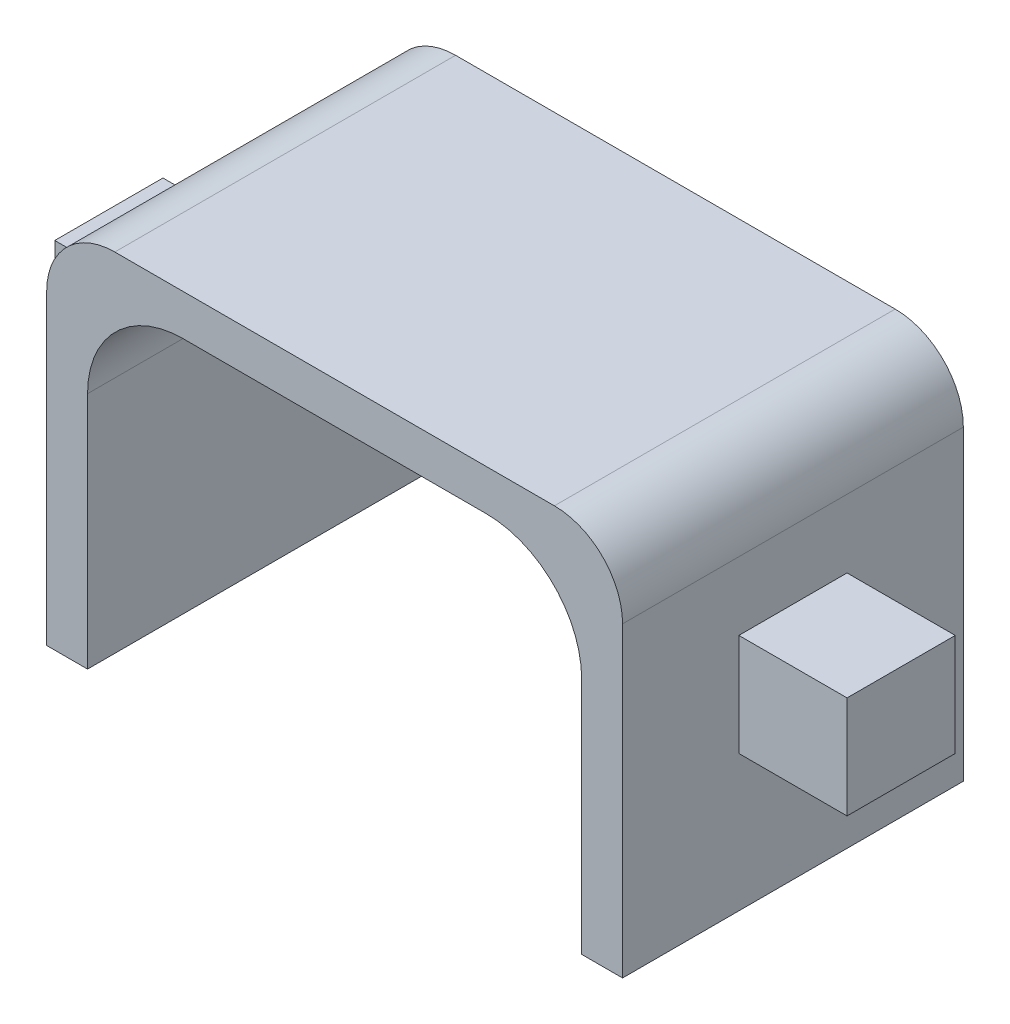
ISO-10303-21;
HEADER;
FILE_DESCRIPTION(('STEP AP214'),'2;1');
FILE_NAME('part.step','',(''),(''),'','','');
FILE_SCHEMA(('AUTOMOTIVE_DESIGN { 1 0 10303 214 1 1 1 1 }'));
ENDSEC;
DATA;
#1=APPLICATION_CONTEXT('core data for automotive mechanical design processes');
#2=APPLICATION_PROTOCOL_DEFINITION('international standard','automotive_design',2000,#1);
#3=PRODUCT_CONTEXT('',#1,'mechanical');
#4=PRODUCT('Part','Part','',(#3));
#5=PRODUCT_RELATED_PRODUCT_CATEGORY('part','',(#4));
#6=PRODUCT_DEFINITION_FORMATION('','',#4);
#7=PRODUCT_DEFINITION_CONTEXT('part definition',#1,'design');
#8=PRODUCT_DEFINITION('design','',#6,#7);
#9=PRODUCT_DEFINITION_SHAPE('','',#8);
#10=(LENGTH_UNIT() NAMED_UNIT(*) SI_UNIT(.MILLI.,.METRE.));
#11=(NAMED_UNIT(*) PLANE_ANGLE_UNIT() SI_UNIT($,.RADIAN.));
#12=(NAMED_UNIT(*) SI_UNIT($,.STERADIAN.) SOLID_ANGLE_UNIT());
#13=UNCERTAINTY_MEASURE_WITH_UNIT(LENGTH_MEASURE(1.E-05),#10,'distance_accuracy_value','');
#14=(GEOMETRIC_REPRESENTATION_CONTEXT(3) GLOBAL_UNCERTAINTY_ASSIGNED_CONTEXT((#13)) GLOBAL_UNIT_ASSIGNED_CONTEXT((#10,
#11,#12)) REPRESENTATION_CONTEXT('',''));
#15=CARTESIAN_POINT('',(0.,0.,0.));
#16=DIRECTION('',(0.,0.,1.));
#17=DIRECTION('',(1.,0.,0.));
#18=AXIS2_PLACEMENT_3D('',#15,#16,#17);
#19=CARTESIAN_POINT('',(0.,0.,1.5875));
#20=DIRECTION('',(0.,0.,-1.));
#21=DIRECTION('',(-1.,0.,0.));
#22=AXIS2_PLACEMENT_3D('',#19,#20,#21);
#23=PLANE('',#22);
#24=DIRECTION('',(0.,-1.,0.));
#25=VECTOR('',#24,1.);
#26=CARTESIAN_POINT('',(-8.45,0.,1.5875));
#27=LINE('',#26,#25);
#28=CARTESIAN_POINT('',(-8.45,7.,1.5875));
#29=VERTEX_POINT('',#28);
#30=CARTESIAN_POINT('',(-8.45,4.,1.5875));
#31=VERTEX_POINT('',#30);
#32=EDGE_CURVE('E209',#29,#31,#27,.T.);
#33=ORIENTED_EDGE('',*,*,#32,.F.);
#34=DIRECTION('',(-1.,0.,0.));
#35=VECTOR('',#34,1.);
#36=CARTESIAN_POINT('',(-8.45,7.,1.5875));
#37=LINE('',#36,#35);
#38=CARTESIAN_POINT('',(-11.625,7.,1.5875));
#39=VERTEX_POINT('',#38);
#40=EDGE_CURVE('E213',#29,#39,#37,.T.);
#41=ORIENTED_EDGE('',*,*,#40,.T.);
#42=DIRECTION('',(0.,-1.,0.));
#43=VECTOR('',#42,1.);
#44=CARTESIAN_POINT('',(-11.625,4.,1.5875));
#45=LINE('',#44,#43);
#46=CARTESIAN_POINT('',(-11.625,4.,1.5875));
#47=VERTEX_POINT('',#46);
#48=EDGE_CURVE('E215',#39,#47,#45,.T.);
#49=ORIENTED_EDGE('',*,*,#48,.T.);
#50=DIRECTION('',(1.,0.,0.));
#51=VECTOR('',#50,1.);
#52=CARTESIAN_POINT('',(-8.45,4.,1.5875));
#53=LINE('',#52,#51);
#54=EDGE_CURVE('E218',#47,#31,#53,.T.);
#55=ORIENTED_EDGE('',*,*,#54,.T.);
#56=EDGE_LOOP('',(#33,#41,#49,#55));
#57=FACE_BOUND('',#56,.T.);
#58=ADVANCED_FACE('F36',(#57),#23,.F.);
#59=DIRECTION('',(0.,1.,0.));
#60=VECTOR('',#59,1.);
#61=CARTESIAN_POINT('',(8.45,0.,1.5875));
#62=LINE('',#61,#60);
#63=CARTESIAN_POINT('',(8.45,4.,1.5875));
#64=VERTEX_POINT('',#63);
#65=CARTESIAN_POINT('',(8.45,7.,1.5875));
#66=VERTEX_POINT('',#65);
#67=EDGE_CURVE('E206',#64,#66,#62,.T.);
#68=ORIENTED_EDGE('',*,*,#67,.F.);
#69=DIRECTION('',(1.,0.,0.));
#70=VECTOR('',#69,1.);
#71=CARTESIAN_POINT('',(8.45,4.,1.5875));
#72=LINE('',#71,#70);
#73=CARTESIAN_POINT('',(11.625,4.,1.5875));
#74=VERTEX_POINT('',#73);
#75=EDGE_CURVE('E220',#64,#74,#72,.T.);
#76=ORIENTED_EDGE('',*,*,#75,.T.);
#77=DIRECTION('',(0.,1.,0.));
#78=VECTOR('',#77,1.);
#79=CARTESIAN_POINT('',(11.625,4.,1.5875));
#80=LINE('',#79,#78);
#81=CARTESIAN_POINT('',(11.625,7.,1.5875));
#82=VERTEX_POINT('',#81);
#83=EDGE_CURVE('E222',#74,#82,#80,.T.);
#84=ORIENTED_EDGE('',*,*,#83,.T.);
#85=DIRECTION('',(-1.,0.,0.));
#86=VECTOR('',#85,1.);
#87=CARTESIAN_POINT('',(8.45,7.,1.5875));
#88=LINE('',#87,#86);
#89=EDGE_CURVE('E224',#82,#66,#88,.T.);
#90=ORIENTED_EDGE('',*,*,#89,.T.);
#91=EDGE_LOOP('',(#68,#76,#84,#90));
#92=FACE_BOUND('',#91,.T.);
#93=ADVANCED_FACE('F371',(#92),#23,.F.);
#94=CARTESIAN_POINT('',(0.,0.,-1.5875));
#95=DIRECTION('',(0.,0.,-1.));
#96=DIRECTION('',(-1.,0.,0.));
#97=AXIS2_PLACEMENT_3D('',#94,#95,#96);
#98=PLANE('',#97);
#99=DIRECTION('',(-1.,0.,0.));
#100=VECTOR('',#99,1.);
#101=CARTESIAN_POINT('',(-8.45,7.,-1.5875));
#102=LINE('',#101,#100);
#103=CARTESIAN_POINT('',(-8.45,7.,-1.5875));
#104=VERTEX_POINT('',#103);
#105=CARTESIAN_POINT('',(-11.625,7.,-1.5875));
#106=VERTEX_POINT('',#105);
#107=EDGE_CURVE('E212',#104,#106,#102,.T.);
#108=ORIENTED_EDGE('',*,*,#107,.F.);
#109=DIRECTION('',(0.,-1.,0.));
#110=VECTOR('',#109,1.);
#111=CARTESIAN_POINT('',(-8.45,0.,-1.5875));
#112=LINE('',#111,#110);
#113=CARTESIAN_POINT('',(-8.45,4.,-1.5875));
#114=VERTEX_POINT('',#113);
#115=EDGE_CURVE('E269',#104,#114,#112,.T.);
#116=ORIENTED_EDGE('',*,*,#115,.T.);
#117=DIRECTION('',(1.,0.,0.));
#118=VECTOR('',#117,1.);
#119=CARTESIAN_POINT('',(-8.45,4.,-1.5875));
#120=LINE('',#119,#118);
#121=CARTESIAN_POINT('',(-11.625,4.,-1.5875));
#122=VERTEX_POINT('',#121);
#123=EDGE_CURVE('E230',#122,#114,#120,.T.);
#124=ORIENTED_EDGE('',*,*,#123,.F.);
#125=DIRECTION('',(0.,-1.,0.));
#126=VECTOR('',#125,1.);
#127=CARTESIAN_POINT('',(-11.625,4.,-1.5875));
#128=LINE('',#127,#126);
#129=EDGE_CURVE('E228',#106,#122,#128,.T.);
#130=ORIENTED_EDGE('',*,*,#129,.F.);
#131=EDGE_LOOP('',(#108,#116,#124,#130));
#132=FACE_BOUND('',#131,.T.);
#133=ADVANCED_FACE('F377',(#132),#98,.T.);
#134=DIRECTION('',(1.,0.,0.));
#135=VECTOR('',#134,1.);
#136=CARTESIAN_POINT('',(8.45,4.,-1.5875));
#137=LINE('',#136,#135);
#138=CARTESIAN_POINT('',(8.45,4.,-1.5875));
#139=VERTEX_POINT('',#138);
#140=CARTESIAN_POINT('',(11.625,4.,-1.5875));
#141=VERTEX_POINT('',#140);
#142=EDGE_CURVE('E233',#139,#141,#137,.T.);
#143=ORIENTED_EDGE('',*,*,#142,.F.);
#144=DIRECTION('',(0.,1.,0.));
#145=VECTOR('',#144,1.);
#146=CARTESIAN_POINT('',(8.45,0.,-1.5875));
#147=LINE('',#146,#145);
#148=CARTESIAN_POINT('',(8.45,7.,-1.5875));
#149=VERTEX_POINT('',#148);
#150=EDGE_CURVE('E267',#139,#149,#147,.T.);
#151=ORIENTED_EDGE('',*,*,#150,.T.);
#152=DIRECTION('',(-1.,0.,0.));
#153=VECTOR('',#152,1.);
#154=CARTESIAN_POINT('',(8.45,7.,-1.5875));
#155=LINE('',#154,#153);
#156=CARTESIAN_POINT('',(11.625,7.,-1.5875));
#157=VERTEX_POINT('',#156);
#158=EDGE_CURVE('E216',#157,#149,#155,.T.);
#159=ORIENTED_EDGE('',*,*,#158,.F.);
#160=DIRECTION('',(0.,1.,0.));
#161=VECTOR('',#160,1.);
#162=CARTESIAN_POINT('',(11.625,4.,-1.5875));
#163=LINE('',#162,#161);
#164=EDGE_CURVE('E235',#141,#157,#163,.T.);
#165=ORIENTED_EDGE('',*,*,#164,.F.);
#166=EDGE_LOOP('',(#143,#151,#159,#165));
#167=FACE_BOUND('',#166,.T.);
#168=ADVANCED_FACE('F384',(#167),#98,.T.);
#169=CARTESIAN_POINT('',(-8.45,11.,1.5875));
#170=DIRECTION('',(0.,-1.,0.));
#171=DIRECTION('',(0.,0.,-1.));
#172=AXIS2_PLACEMENT_3D('',#169,#170,#171);
#173=PLANE('',#172);
#174=DIRECTION('',(-1.,0.,0.));
#175=VECTOR('',#174,1.);
#176=CARTESIAN_POINT('',(8.45,11.,5.));
#177=LINE('',#176,#175);
#178=CARTESIAN_POINT('',(6.45,11.,5.));
#179=VERTEX_POINT('',#178);
#180=CARTESIAN_POINT('',(-6.45,11.,5.));
#181=VERTEX_POINT('',#180);
#182=EDGE_CURVE('E287',#179,#181,#177,.T.);
#183=ORIENTED_EDGE('',*,*,#182,.F.);
#184=DIRECTION('',(0.,0.,-1.));
#185=VECTOR('',#184,1.);
#186=CARTESIAN_POINT('',(6.45,11.,1.5875));
#187=LINE('',#186,#185);
#188=CARTESIAN_POINT('',(6.45,11.,-5.));
#189=VERTEX_POINT('',#188);
#190=EDGE_CURVE('E273',#179,#189,#187,.T.);
#191=ORIENTED_EDGE('',*,*,#190,.T.);
#192=DIRECTION('',(-1.,0.,0.));
#193=VECTOR('',#192,1.);
#194=CARTESIAN_POINT('',(8.45,11.,-5.));
#195=LINE('',#194,#193);
#196=CARTESIAN_POINT('',(-6.45,11.,-5.));
#197=VERTEX_POINT('',#196);
#198=EDGE_CURVE('E300',#189,#197,#195,.T.);
#199=ORIENTED_EDGE('',*,*,#198,.T.);
#200=DIRECTION('',(0.,0.,-1.));
#201=VECTOR('',#200,1.);
#202=CARTESIAN_POINT('',(-6.45,11.,1.5875));
#203=LINE('',#202,#201);
#204=EDGE_CURVE('E271',#197,#181,#203,.F.);
#205=ORIENTED_EDGE('',*,*,#204,.T.);
#206=EDGE_LOOP('',(#183,#191,#199,#205));
#207=FACE_BOUND('',#206,.T.);
#208=ADVANCED_FACE('F293',(#207),#173,.F.);
#209=CARTESIAN_POINT('',(-8.45,7.,1.5875));
#210=DIRECTION('',(0.,-1.,0.));
#211=DIRECTION('',(0.,0.,-1.));
#212=AXIS2_PLACEMENT_3D('',#209,#210,#211);
#213=PLANE('',#212);
#214=ORIENTED_EDGE('',*,*,#107,.T.);
#215=DIRECTION('',(0.,0.,-1.));
#216=VECTOR('',#215,1.);
#217=CARTESIAN_POINT('',(-11.625,7.,1.5875));
#218=LINE('',#217,#216);
#219=EDGE_CURVE('E261',#39,#106,#218,.T.);
#220=ORIENTED_EDGE('',*,*,#219,.F.);
#221=ORIENTED_EDGE('',*,*,#40,.F.);
#222=DIRECTION('',(0.,0.,-1.));
#223=VECTOR('',#222,1.);
#224=CARTESIAN_POINT('',(-8.45,7.,1.5875));
#225=LINE('',#224,#223);
#226=EDGE_CURVE('E264',#29,#104,#225,.T.);
#227=ORIENTED_EDGE('',*,*,#226,.T.);
#228=EDGE_LOOP('',(#214,#220,#221,#227));
#229=FACE_BOUND('',#228,.T.);
#230=ADVANCED_FACE('F415',(#229),#213,.F.);
#231=CARTESIAN_POINT('',(-11.625,4.,1.5875));
#232=DIRECTION('',(1.,0.,0.));
#233=DIRECTION('',(0.,1.,0.));
#234=AXIS2_PLACEMENT_3D('',#231,#232,#233);
#235=PLANE('',#234);
#236=ORIENTED_EDGE('',*,*,#129,.T.);
#237=DIRECTION('',(0.,0.,-1.));
#238=VECTOR('',#237,1.);
#239=CARTESIAN_POINT('',(-11.625,4.,1.5875));
#240=LINE('',#239,#238);
#241=EDGE_CURVE('E258',#47,#122,#240,.T.);
#242=ORIENTED_EDGE('',*,*,#241,.F.);
#243=ORIENTED_EDGE('',*,*,#48,.F.);
#244=ORIENTED_EDGE('',*,*,#219,.T.);
#245=EDGE_LOOP('',(#236,#242,#243,#244));
#246=FACE_BOUND('',#245,.T.);
#247=ADVANCED_FACE('F411',(#246),#235,.F.);
#248=CARTESIAN_POINT('',(-8.45,4.,1.5875));
#249=DIRECTION('',(0.,1.,0.));
#250=DIRECTION('',(0.,0.,1.));
#251=AXIS2_PLACEMENT_3D('',#248,#249,#250);
#252=PLANE('',#251);
#253=ORIENTED_EDGE('',*,*,#123,.T.);
#254=DIRECTION('',(0.,0.,-1.));
#255=VECTOR('',#254,1.);
#256=CARTESIAN_POINT('',(-8.45,4.,1.5875));
#257=LINE('',#256,#255);
#258=EDGE_CURVE('E255',#31,#114,#257,.T.);
#259=ORIENTED_EDGE('',*,*,#258,.F.);
#260=ORIENTED_EDGE('',*,*,#54,.F.);
#261=ORIENTED_EDGE('',*,*,#241,.T.);
#262=EDGE_LOOP('',(#253,#259,#260,#261));
#263=FACE_BOUND('',#262,.T.);
#264=ADVANCED_FACE('F407',(#263),#252,.F.);
#265=CARTESIAN_POINT('',(-8.45,4.,1.5875));
#266=DIRECTION('',(1.,0.,0.));
#267=DIRECTION('',(0.,0.,-1.));
#268=AXIS2_PLACEMENT_3D('',#265,#266,#267);
#269=PLANE('',#268);
#270=ORIENTED_EDGE('',*,*,#226,.F.);
#271=ORIENTED_EDGE('',*,*,#32,.T.);
#272=ORIENTED_EDGE('',*,*,#258,.T.);
#273=ORIENTED_EDGE('',*,*,#115,.F.);
#274=EDGE_LOOP('',(#270,#271,#272,#273));
#275=FACE_BOUND('',#274,.T.);
#276=DIRECTION('',(0.,-1.,0.));
#277=VECTOR('',#276,1.);
#278=CARTESIAN_POINT('',(-8.45,11.,5.));
#279=LINE('',#278,#277);
#280=CARTESIAN_POINT('',(-8.45,9.,5.));
#281=VERTEX_POINT('',#280);
#282=CARTESIAN_POINT('',(-8.45,0.,5.));
#283=VERTEX_POINT('',#282);
#284=EDGE_CURVE('E297',#281,#283,#279,.T.);
#285=ORIENTED_EDGE('',*,*,#284,.F.);
#286=DIRECTION('',(0.,0.,-1.));
#287=VECTOR('',#286,1.);
#288=CARTESIAN_POINT('',(-8.45,9.,1.5875));
#289=LINE('',#288,#287);
#290=CARTESIAN_POINT('',(-8.45,9.,-5.));
#291=VERTEX_POINT('',#290);
#292=EDGE_CURVE('E11',#281,#291,#289,.T.);
#293=ORIENTED_EDGE('',*,*,#292,.T.);
#294=DIRECTION('',(0.,-1.,0.));
#295=VECTOR('',#294,1.);
#296=CARTESIAN_POINT('',(-8.45,4.,-5.));
#297=LINE('',#296,#295);
#298=CARTESIAN_POINT('',(-8.45,0.,-5.));
#299=VERTEX_POINT('',#298);
#300=EDGE_CURVE('E202',#291,#299,#297,.T.);
#301=ORIENTED_EDGE('',*,*,#300,.T.);
#302=DIRECTION('',(0.,0.,-1.));
#303=VECTOR('',#302,1.);
#304=CARTESIAN_POINT('',(-8.45,0.,1.5875));
#305=LINE('',#304,#303);
#306=EDGE_CURVE('E252',#283,#299,#305,.T.);
#307=ORIENTED_EDGE('',*,*,#306,.F.);
#308=EDGE_LOOP('',(#285,#293,#301,#307));
#309=FACE_BOUND('',#308,.T.);
#310=ADVANCED_FACE('F315',(#275,#309),#269,.F.);
#311=CARTESIAN_POINT('',(-6.45,0.,1.5875));
#312=DIRECTION('',(0.,1.,0.));
#313=DIRECTION('',(0.,0.,1.));
#314=AXIS2_PLACEMENT_3D('',#311,#312,#313);
#315=PLANE('',#314);
#316=DIRECTION('',(1.,0.,0.));
#317=VECTOR('',#316,1.);
#318=CARTESIAN_POINT('',(-8.45,0.,-5.));
#319=LINE('',#318,#317);
#320=CARTESIAN_POINT('',(-7.25,0.,-5.));
#321=VERTEX_POINT('',#320);
#322=EDGE_CURVE('E197',#299,#321,#319,.T.);
#323=ORIENTED_EDGE('',*,*,#322,.T.);
#324=DIRECTION('',(0.,0.,1.));
#325=VECTOR('',#324,1.);
#326=CARTESIAN_POINT('',(-7.25,0.,-5.));
#327=LINE('',#326,#325);
#328=CARTESIAN_POINT('',(-7.25,0.,5.));
#329=VERTEX_POINT('',#328);
#330=EDGE_CURVE('E311',#321,#329,#327,.T.);
#331=ORIENTED_EDGE('',*,*,#330,.T.);
#332=DIRECTION('',(1.,0.,0.));
#333=VECTOR('',#332,1.);
#334=CARTESIAN_POINT('',(-8.45,0.,5.));
#335=LINE('',#334,#333);
#336=EDGE_CURVE('E307',#283,#329,#335,.T.);
#337=ORIENTED_EDGE('',*,*,#336,.F.);
#338=ORIENTED_EDGE('',*,*,#306,.T.);
#339=EDGE_LOOP('',(#323,#331,#337,#338));
#340=FACE_BOUND('',#339,.T.);
#341=ADVANCED_FACE('F320',(#340),#315,.F.);
#342=CARTESIAN_POINT('',(6.45,0.,1.5875));
#343=DIRECTION('',(0.,1.,0.));
#344=DIRECTION('',(0.,0.,1.));
#345=AXIS2_PLACEMENT_3D('',#342,#343,#344);
#346=PLANE('',#345);
#347=DIRECTION('',(1.,0.,0.));
#348=VECTOR('',#347,1.);
#349=CARTESIAN_POINT('',(6.45,0.,5.));
#350=LINE('',#349,#348);
#351=CARTESIAN_POINT('',(7.25,0.,5.));
#352=VERTEX_POINT('',#351);
#353=CARTESIAN_POINT('',(8.45,0.,5.));
#354=VERTEX_POINT('',#353);
#355=EDGE_CURVE('E189',#352,#354,#350,.T.);
#356=ORIENTED_EDGE('',*,*,#355,.F.);
#357=DIRECTION('',(0.,0.,1.));
#358=VECTOR('',#357,1.);
#359=CARTESIAN_POINT('',(7.25,0.,-5.));
#360=LINE('',#359,#358);
#361=CARTESIAN_POINT('',(7.25,0.,-5.));
#362=VERTEX_POINT('',#361);
#363=EDGE_CURVE('E51',#362,#352,#360,.T.);
#364=ORIENTED_EDGE('',*,*,#363,.F.);
#365=DIRECTION('',(1.,0.,0.));
#366=VECTOR('',#365,1.);
#367=CARTESIAN_POINT('',(6.45,0.,-5.));
#368=LINE('',#367,#366);
#369=CARTESIAN_POINT('',(8.45,0.,-5.));
#370=VERTEX_POINT('',#369);
#371=EDGE_CURVE('E187',#362,#370,#368,.T.);
#372=ORIENTED_EDGE('',*,*,#371,.T.);
#373=DIRECTION('',(0.,0.,-1.));
#374=VECTOR('',#373,1.);
#375=CARTESIAN_POINT('',(8.45,0.,1.5875));
#376=LINE('',#375,#374);
#377=EDGE_CURVE('E250',#354,#370,#376,.T.);
#378=ORIENTED_EDGE('',*,*,#377,.F.);
#379=EDGE_LOOP('',(#356,#364,#372,#378));
#380=FACE_BOUND('',#379,.T.);
#381=ADVANCED_FACE('F185',(#380),#346,.F.);
#382=CARTESIAN_POINT('',(8.45,4.,1.5875));
#383=DIRECTION('',(0.,1.,0.));
#384=DIRECTION('',(0.,0.,1.));
#385=AXIS2_PLACEMENT_3D('',#382,#383,#384);
#386=PLANE('',#385);
#387=ORIENTED_EDGE('',*,*,#142,.T.);
#388=DIRECTION('',(0.,0.,-1.));
#389=VECTOR('',#388,1.);
#390=CARTESIAN_POINT('',(11.625,4.,1.5875));
#391=LINE('',#390,#389);
#392=EDGE_CURVE('E244',#74,#141,#391,.T.);
#393=ORIENTED_EDGE('',*,*,#392,.F.);
#394=ORIENTED_EDGE('',*,*,#75,.F.);
#395=DIRECTION('',(0.,0.,-1.));
#396=VECTOR('',#395,1.);
#397=CARTESIAN_POINT('',(8.45,4.,1.5875));
#398=LINE('',#397,#396);
#399=EDGE_CURVE('E247',#64,#139,#398,.T.);
#400=ORIENTED_EDGE('',*,*,#399,.T.);
#401=EDGE_LOOP('',(#387,#393,#394,#400));
#402=FACE_BOUND('',#401,.T.);
#403=ADVANCED_FACE('F396',(#402),#386,.F.);
#404=CARTESIAN_POINT('',(11.625,4.,1.5875));
#405=DIRECTION('',(-1.,0.,0.));
#406=DIRECTION('',(0.,-1.,0.));
#407=AXIS2_PLACEMENT_3D('',#404,#405,#406);
#408=PLANE('',#407);
#409=ORIENTED_EDGE('',*,*,#164,.T.);
#410=DIRECTION('',(0.,0.,-1.));
#411=VECTOR('',#410,1.);
#412=CARTESIAN_POINT('',(11.625,7.,1.5875));
#413=LINE('',#412,#411);
#414=EDGE_CURVE('E241',#82,#157,#413,.T.);
#415=ORIENTED_EDGE('',*,*,#414,.F.);
#416=ORIENTED_EDGE('',*,*,#83,.F.);
#417=ORIENTED_EDGE('',*,*,#392,.T.);
#418=EDGE_LOOP('',(#409,#415,#416,#417));
#419=FACE_BOUND('',#418,.T.);
#420=ADVANCED_FACE('F392',(#419),#408,.F.);
#421=CARTESIAN_POINT('',(8.45,7.,1.5875));
#422=DIRECTION('',(0.,-1.,0.));
#423=DIRECTION('',(0.,0.,-1.));
#424=AXIS2_PLACEMENT_3D('',#421,#422,#423);
#425=PLANE('',#424);
#426=ORIENTED_EDGE('',*,*,#158,.T.);
#427=DIRECTION('',(0.,0.,-1.));
#428=VECTOR('',#427,1.);
#429=CARTESIAN_POINT('',(8.45,7.,1.5875));
#430=LINE('',#429,#428);
#431=EDGE_CURVE('E226',#66,#149,#430,.T.);
#432=ORIENTED_EDGE('',*,*,#431,.F.);
#433=ORIENTED_EDGE('',*,*,#89,.F.);
#434=ORIENTED_EDGE('',*,*,#414,.T.);
#435=EDGE_LOOP('',(#426,#432,#433,#434));
#436=FACE_BOUND('',#435,.T.);
#437=ADVANCED_FACE('F388',(#436),#425,.F.);
#438=CARTESIAN_POINT('',(8.45,11.,1.5875));
#439=DIRECTION('',(-1.,0.,0.));
#440=DIRECTION('',(0.,0.,1.));
#441=AXIS2_PLACEMENT_3D('',#438,#439,#440);
#442=PLANE('',#441);
#443=ORIENTED_EDGE('',*,*,#399,.F.);
#444=ORIENTED_EDGE('',*,*,#67,.T.);
#445=ORIENTED_EDGE('',*,*,#431,.T.);
#446=ORIENTED_EDGE('',*,*,#150,.F.);
#447=EDGE_LOOP('',(#443,#444,#445,#446));
#448=FACE_BOUND('',#447,.T.);
#449=DIRECTION('',(0.,1.,0.));
#450=VECTOR('',#449,1.);
#451=CARTESIAN_POINT('',(8.45,7.,-5.));
#452=LINE('',#451,#450);
#453=CARTESIAN_POINT('',(8.45,9.,-5.));
#454=VERTEX_POINT('',#453);
#455=EDGE_CURVE('E196',#370,#454,#452,.T.);
#456=ORIENTED_EDGE('',*,*,#455,.T.);
#457=DIRECTION('',(0.,0.,-1.));
#458=VECTOR('',#457,1.);
#459=CARTESIAN_POINT('',(8.45,9.,1.5875));
#460=LINE('',#459,#458);
#461=CARTESIAN_POINT('',(8.45,9.,5.));
#462=VERTEX_POINT('',#461);
#463=EDGE_CURVE('E280',#454,#462,#460,.F.);
#464=ORIENTED_EDGE('',*,*,#463,.T.);
#465=DIRECTION('',(0.,1.,0.));
#466=VECTOR('',#465,1.);
#467=CARTESIAN_POINT('',(8.45,7.,5.));
#468=LINE('',#467,#466);
#469=EDGE_CURVE('E199',#354,#462,#468,.T.);
#470=ORIENTED_EDGE('',*,*,#469,.F.);
#471=ORIENTED_EDGE('',*,*,#377,.T.);
#472=EDGE_LOOP('',(#456,#464,#470,#471));
#473=FACE_BOUND('',#472,.T.);
#474=ADVANCED_FACE('F302',(#448,#473),#442,.F.);
#475=CARTESIAN_POINT('',(0.,0.,-5.));
#476=DIRECTION('',(0.,0.,1.));
#477=DIRECTION('',(1.,0.,0.));
#478=AXIS2_PLACEMENT_3D('',#475,#476,#477);
#479=PLANE('',#478);
#480=CARTESIAN_POINT('',(-4.45,7.,-5.));
#481=DIRECTION('',(0.,0.,1.));
#482=DIRECTION('',(1.,0.,0.));
#483=AXIS2_PLACEMENT_3D('',#480,#481,#482);
#484=CIRCLE('',#483,2.8);
#485=CARTESIAN_POINT('',(-4.45,9.8,-5.));
#486=VERTEX_POINT('',#485);
#487=CARTESIAN_POINT('',(-7.25,7.,-5.));
#488=VERTEX_POINT('',#487);
#489=EDGE_CURVE('E326',#486,#488,#484,.T.);
#490=ORIENTED_EDGE('',*,*,#489,.T.);
#491=DIRECTION('',(0.,-1.,0.));
#492=VECTOR('',#491,1.);
#493=CARTESIAN_POINT('',(-7.25,0.,-5.));
#494=LINE('',#493,#492);
#495=EDGE_CURVE('E190',#488,#321,#494,.T.);
#496=ORIENTED_EDGE('',*,*,#495,.T.);
#497=ORIENTED_EDGE('',*,*,#322,.F.);
#498=ORIENTED_EDGE('',*,*,#300,.F.);
#499=CARTESIAN_POINT('',(-6.45,9.,-5.));
#500=DIRECTION('',(0.,0.,1.));
#501=DIRECTION('',(1.,0.,0.));
#502=AXIS2_PLACEMENT_3D('',#499,#500,#501);
#503=CIRCLE('',#502,2.);
#504=EDGE_CURVE('E276',#291,#197,#503,.F.);
#505=ORIENTED_EDGE('',*,*,#504,.T.);
#506=ORIENTED_EDGE('',*,*,#198,.F.);
#507=CARTESIAN_POINT('',(6.45,9.,-5.));
#508=DIRECTION('',(0.,0.,1.));
#509=DIRECTION('',(1.,0.,0.));
#510=AXIS2_PLACEMENT_3D('',#507,#508,#509);
#511=CIRCLE('',#510,2.);
#512=EDGE_CURVE('E278',#189,#454,#511,.F.);
#513=ORIENTED_EDGE('',*,*,#512,.T.);
#514=ORIENTED_EDGE('',*,*,#455,.F.);
#515=ORIENTED_EDGE('',*,*,#371,.F.);
#516=DIRECTION('',(0.,1.,0.));
#517=VECTOR('',#516,1.);
#518=CARTESIAN_POINT('',(7.25,7.,-5.));
#519=LINE('',#518,#517);
#520=CARTESIAN_POINT('',(7.25,7.,-5.));
#521=VERTEX_POINT('',#520);
#522=EDGE_CURVE('E173',#362,#521,#519,.T.);
#523=ORIENTED_EDGE('',*,*,#522,.T.);
#524=CARTESIAN_POINT('',(4.45,7.,-5.));
#525=DIRECTION('',(0.,0.,1.));
#526=DIRECTION('',(1.,0.,0.));
#527=AXIS2_PLACEMENT_3D('',#524,#525,#526);
#528=CIRCLE('',#527,2.8);
#529=CARTESIAN_POINT('',(4.44999999999999,9.8,-5.));
#530=VERTEX_POINT('',#529);
#531=EDGE_CURVE('E180',#521,#530,#528,.T.);
#532=ORIENTED_EDGE('',*,*,#531,.T.);
#533=DIRECTION('',(-1.,0.,0.));
#534=VECTOR('',#533,1.);
#535=CARTESIAN_POINT('',(-4.45,9.8,-5.));
#536=LINE('',#535,#534);
#537=EDGE_CURVE('E329',#530,#486,#536,.T.);
#538=ORIENTED_EDGE('',*,*,#537,.T.);
#539=EDGE_LOOP('',(#490,#496,#497,#498,#505,#506,#513,#514,#515,#523,#532,#538));
#540=FACE_BOUND('',#539,.T.);
#541=ADVANCED_FACE('F194',(#540),#479,.F.);
#542=CARTESIAN_POINT('',(0.,0.,5.));
#543=DIRECTION('',(0.,0.,1.));
#544=DIRECTION('',(1.,0.,0.));
#545=AXIS2_PLACEMENT_3D('',#542,#543,#544);
#546=PLANE('',#545);
#547=DIRECTION('',(0.,-1.,0.));
#548=VECTOR('',#547,1.);
#549=CARTESIAN_POINT('',(-7.25,0.,5.));
#550=LINE('',#549,#548);
#551=CARTESIAN_POINT('',(-7.25,7.,5.));
#552=VERTEX_POINT('',#551);
#553=EDGE_CURVE('E181',#552,#329,#550,.T.);
#554=ORIENTED_EDGE('',*,*,#553,.F.);
#555=CARTESIAN_POINT('',(-4.45,7.,5.));
#556=DIRECTION('',(0.,0.,1.));
#557=DIRECTION('',(1.,0.,0.));
#558=AXIS2_PLACEMENT_3D('',#555,#556,#557);
#559=CIRCLE('',#558,2.8);
#560=CARTESIAN_POINT('',(-4.45,9.8,5.));
#561=VERTEX_POINT('',#560);
#562=EDGE_CURVE('E341',#561,#552,#559,.T.);
#563=ORIENTED_EDGE('',*,*,#562,.F.);
#564=DIRECTION('',(-1.,0.,0.));
#565=VECTOR('',#564,1.);
#566=CARTESIAN_POINT('',(-4.45,9.8,5.));
#567=LINE('',#566,#565);
#568=CARTESIAN_POINT('',(4.44999999999999,9.8,5.));
#569=VERTEX_POINT('',#568);
#570=EDGE_CURVE('E338',#569,#561,#567,.T.);
#571=ORIENTED_EDGE('',*,*,#570,.F.);
#572=CARTESIAN_POINT('',(4.45,7.,5.));
#573=DIRECTION('',(0.,0.,1.));
#574=DIRECTION('',(1.,0.,0.));
#575=AXIS2_PLACEMENT_3D('',#572,#573,#574);
#576=CIRCLE('',#575,2.8);
#577=CARTESIAN_POINT('',(7.25,7.,5.));
#578=VERTEX_POINT('',#577);
#579=EDGE_CURVE('E335',#578,#569,#576,.T.);
#580=ORIENTED_EDGE('',*,*,#579,.F.);
#581=DIRECTION('',(0.,1.,0.));
#582=VECTOR('',#581,1.);
#583=CARTESIAN_POINT('',(7.25,7.,5.));
#584=LINE('',#583,#582);
#585=EDGE_CURVE('E333',#352,#578,#584,.T.);
#586=ORIENTED_EDGE('',*,*,#585,.F.);
#587=ORIENTED_EDGE('',*,*,#355,.T.);
#588=ORIENTED_EDGE('',*,*,#469,.T.);
#589=CARTESIAN_POINT('',(6.45,9.,5.));
#590=DIRECTION('',(0.,0.,1.));
#591=DIRECTION('',(1.,0.,0.));
#592=AXIS2_PLACEMENT_3D('',#589,#590,#591);
#593=CIRCLE('',#592,2.);
#594=EDGE_CURVE('E44',#462,#179,#593,.T.);
#595=ORIENTED_EDGE('',*,*,#594,.T.);
#596=ORIENTED_EDGE('',*,*,#182,.T.);
#597=CARTESIAN_POINT('',(-6.45,9.,5.));
#598=DIRECTION('',(0.,0.,1.));
#599=DIRECTION('',(1.,0.,0.));
#600=AXIS2_PLACEMENT_3D('',#597,#598,#599);
#601=CIRCLE('',#600,2.);
#602=EDGE_CURVE('E59',#181,#281,#601,.T.);
#603=ORIENTED_EDGE('',*,*,#602,.T.);
#604=ORIENTED_EDGE('',*,*,#284,.T.);
#605=ORIENTED_EDGE('',*,*,#336,.T.);
#606=EDGE_LOOP('',(#554,#563,#571,#580,#586,#587,#588,#595,#596,#603,#604,#605));
#607=FACE_BOUND('',#606,.T.);
#608=ADVANCED_FACE('F286',(#607),#546,.T.);
#609=CARTESIAN_POINT('',(6.45,9.,1.5875));
#610=DIRECTION('',(0.,0.,-1.));
#611=DIRECTION('',(-1.,0.,0.));
#612=AXIS2_PLACEMENT_3D('',#609,#610,#611);
#613=CYLINDRICAL_SURFACE('',#612,2.);
#614=ORIENTED_EDGE('',*,*,#594,.F.);
#615=ORIENTED_EDGE('',*,*,#463,.F.);
#616=ORIENTED_EDGE('',*,*,#512,.F.);
#617=ORIENTED_EDGE('',*,*,#190,.F.);
#618=EDGE_LOOP('',(#614,#615,#616,#617));
#619=FACE_BOUND('',#618,.T.);
#620=ADVANCED_FACE('F299',(#619),#613,.T.);
#621=CARTESIAN_POINT('',(-6.45,9.,1.5875));
#622=DIRECTION('',(0.,0.,-1.));
#623=DIRECTION('',(-1.,0.,0.));
#624=AXIS2_PLACEMENT_3D('',#621,#622,#623);
#625=CYLINDRICAL_SURFACE('',#624,2.);
#626=ORIENTED_EDGE('',*,*,#602,.F.);
#627=ORIENTED_EDGE('',*,*,#204,.F.);
#628=ORIENTED_EDGE('',*,*,#504,.F.);
#629=ORIENTED_EDGE('',*,*,#292,.F.);
#630=EDGE_LOOP('',(#626,#627,#628,#629));
#631=FACE_BOUND('',#630,.T.);
#632=ADVANCED_FACE('F38',(#631),#625,.T.);
#633=CARTESIAN_POINT('',(-7.25,0.,-5.));
#634=DIRECTION('',(-1.,0.,0.));
#635=DIRECTION('',(0.,-1.,0.));
#636=AXIS2_PLACEMENT_3D('',#633,#634,#635);
#637=PLANE('',#636);
#638=ORIENTED_EDGE('',*,*,#553,.T.);
#639=ORIENTED_EDGE('',*,*,#330,.F.);
#640=ORIENTED_EDGE('',*,*,#495,.F.);
#641=DIRECTION('',(0.,0.,1.));
#642=VECTOR('',#641,1.);
#643=CARTESIAN_POINT('',(-7.25,7.,-5.));
#644=LINE('',#643,#642);
#645=EDGE_CURVE('E346',#488,#552,#644,.T.);
#646=ORIENTED_EDGE('',*,*,#645,.T.);
#647=EDGE_LOOP('',(#638,#639,#640,#646));
#648=FACE_BOUND('',#647,.T.);
#649=ADVANCED_FACE('F362',(#648),#637,.F.);
#650=CARTESIAN_POINT('',(-4.45,7.,-5.));
#651=DIRECTION('',(0.,0.,1.));
#652=DIRECTION('',(1.,0.,0.));
#653=AXIS2_PLACEMENT_3D('',#650,#651,#652);
#654=CYLINDRICAL_SURFACE('',#653,2.8);
#655=ORIENTED_EDGE('',*,*,#562,.T.);
#656=ORIENTED_EDGE('',*,*,#645,.F.);
#657=ORIENTED_EDGE('',*,*,#489,.F.);
#658=DIRECTION('',(0.,0.,1.));
#659=VECTOR('',#658,1.);
#660=CARTESIAN_POINT('',(-4.45,9.8,-5.));
#661=LINE('',#660,#659);
#662=EDGE_CURVE('E348',#486,#561,#661,.T.);
#663=ORIENTED_EDGE('',*,*,#662,.T.);
#664=EDGE_LOOP('',(#655,#656,#657,#663));
#665=FACE_BOUND('',#664,.T.);
#666=ADVANCED_FACE('F361',(#665),#654,.F.);
#667=CARTESIAN_POINT('',(-4.45,9.8,-5.));
#668=DIRECTION('',(0.,1.,0.));
#669=DIRECTION('',(0.,0.,1.));
#670=AXIS2_PLACEMENT_3D('',#667,#668,#669);
#671=PLANE('',#670);
#672=ORIENTED_EDGE('',*,*,#570,.T.);
#673=ORIENTED_EDGE('',*,*,#662,.F.);
#674=ORIENTED_EDGE('',*,*,#537,.F.);
#675=DIRECTION('',(0.,0.,1.));
#676=VECTOR('',#675,1.);
#677=CARTESIAN_POINT('',(4.44999999999999,9.8,-5.));
#678=LINE('',#677,#676);
#679=EDGE_CURVE('E350',#530,#569,#678,.T.);
#680=ORIENTED_EDGE('',*,*,#679,.T.);
#681=EDGE_LOOP('',(#672,#673,#674,#680));
#682=FACE_BOUND('',#681,.T.);
#683=ADVANCED_FACE('F357',(#682),#671,.F.);
#684=CARTESIAN_POINT('',(4.45,7.,-5.));
#685=DIRECTION('',(0.,0.,1.));
#686=DIRECTION('',(1.,0.,0.));
#687=AXIS2_PLACEMENT_3D('',#684,#685,#686);
#688=CYLINDRICAL_SURFACE('',#687,2.8);
#689=ORIENTED_EDGE('',*,*,#579,.T.);
#690=ORIENTED_EDGE('',*,*,#679,.F.);
#691=ORIENTED_EDGE('',*,*,#531,.F.);
#692=DIRECTION('',(0.,0.,1.));
#693=VECTOR('',#692,1.);
#694=CARTESIAN_POINT('',(7.25,7.,-5.));
#695=LINE('',#694,#693);
#696=EDGE_CURVE('E175',#521,#578,#695,.T.);
#697=ORIENTED_EDGE('',*,*,#696,.T.);
#698=EDGE_LOOP('',(#689,#690,#691,#697));
#699=FACE_BOUND('',#698,.T.);
#700=ADVANCED_FACE('F352',(#699),#688,.F.);
#701=CARTESIAN_POINT('',(7.25,7.,-5.));
#702=DIRECTION('',(1.,0.,0.));
#703=DIRECTION('',(0.,0.,-1.));
#704=AXIS2_PLACEMENT_3D('',#701,#702,#703);
#705=PLANE('',#704);
#706=ORIENTED_EDGE('',*,*,#585,.T.);
#707=ORIENTED_EDGE('',*,*,#696,.F.);
#708=ORIENTED_EDGE('',*,*,#522,.F.);
#709=ORIENTED_EDGE('',*,*,#363,.T.);
#710=EDGE_LOOP('',(#706,#707,#708,#709));
#711=FACE_BOUND('',#710,.T.);
#712=ADVANCED_FACE('F174',(#711),#705,.F.);
#713=CLOSED_SHELL('',(#58,#93,#133,#168,#208,#230,#247,#264,#310,#341,#381,#403,#420,#437,#474,
#541,#608,#620,#632,#649,#666,#683,#700,#712));
#714=MANIFOLD_SOLID_BREP('B2',#713);
#715=ADVANCED_BREP_SHAPE_REPRESENTATION('',(#18,#714),#14);
#716=SHAPE_DEFINITION_REPRESENTATION(#9,#715);
ENDSEC;
END-ISO-10303-21;
